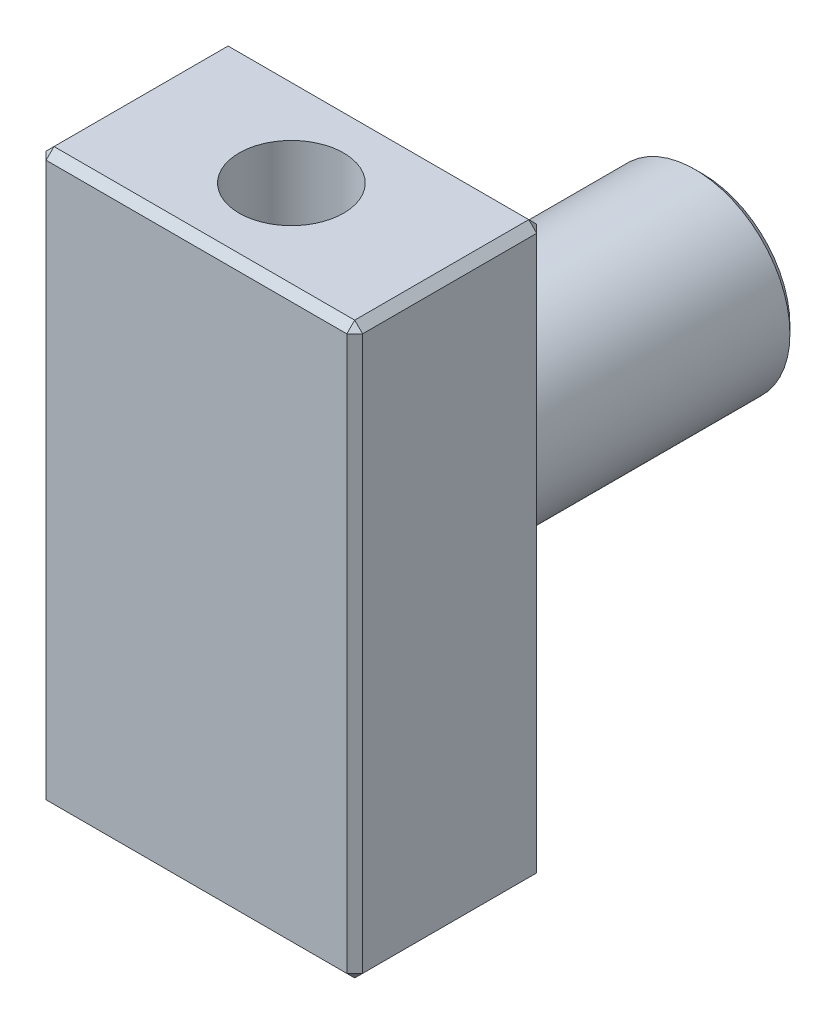
ISO-10303-21;
HEADER;
FILE_DESCRIPTION(('STEP AP214'),'2;1');
FILE_NAME('part.step','',(''),(''),'','','');
FILE_SCHEMA(('AUTOMOTIVE_DESIGN { 1 0 10303 214 1 1 1 1 }'));
ENDSEC;
DATA;
#1=APPLICATION_CONTEXT('core data for automotive mechanical design processes');
#2=APPLICATION_PROTOCOL_DEFINITION('international standard','automotive_design',2000,#1);
#3=PRODUCT_CONTEXT('',#1,'mechanical');
#4=PRODUCT('Part','Part','',(#3));
#5=PRODUCT_RELATED_PRODUCT_CATEGORY('part','',(#4));
#6=PRODUCT_DEFINITION_FORMATION('','',#4);
#7=PRODUCT_DEFINITION_CONTEXT('part definition',#1,'design');
#8=PRODUCT_DEFINITION('design','',#6,#7);
#9=PRODUCT_DEFINITION_SHAPE('','',#8);
#10=(LENGTH_UNIT() NAMED_UNIT(*) SI_UNIT(.MILLI.,.METRE.));
#11=(NAMED_UNIT(*) PLANE_ANGLE_UNIT() SI_UNIT($,.RADIAN.));
#12=(NAMED_UNIT(*) SI_UNIT($,.STERADIAN.) SOLID_ANGLE_UNIT());
#13=UNCERTAINTY_MEASURE_WITH_UNIT(LENGTH_MEASURE(1.E-05),#10,'distance_accuracy_value','');
#14=(GEOMETRIC_REPRESENTATION_CONTEXT(3) GLOBAL_UNCERTAINTY_ASSIGNED_CONTEXT((#13)) GLOBAL_UNIT_ASSIGNED_CONTEXT((#10,
#11,#12)) REPRESENTATION_CONTEXT('',''));
#15=CARTESIAN_POINT('',(0.,0.,0.));
#16=DIRECTION('',(0.,0.,1.));
#17=DIRECTION('',(1.,0.,0.));
#18=AXIS2_PLACEMENT_3D('',#15,#16,#17);
#19=CARTESIAN_POINT('',(-5.,-9.,0.));
#20=DIRECTION('',(0.,0.,1.));
#21=DIRECTION('',(1.,0.,0.));
#22=AXIS2_PLACEMENT_3D('',#19,#20,#21);
#23=PLANE('',#22);
#24=CARTESIAN_POINT('',(0.,0.,0.));
#25=DIRECTION('',(0.,0.,1.));
#26=DIRECTION('',(1.,0.,0.));
#27=AXIS2_PLACEMENT_3D('',#24,#25,#26);
#28=CIRCLE('',#27,3.25);
#29=CARTESIAN_POINT('',(3.25,0.,0.));
#30=VERTEX_POINT('',#29);
#31=EDGE_CURVE('E163',#30,#30,#28,.T.);
#32=ORIENTED_EDGE('',*,*,#31,.T.);
#33=EDGE_LOOP('',(#32));
#34=FACE_BOUND('',#33,.T.);
#35=DIRECTION('',(0.,-1.,0.));
#36=VECTOR('',#35,1.);
#37=CARTESIAN_POINT('',(4.75,-9.,0.));
#38=LINE('',#37,#36);
#39=CARTESIAN_POINT('',(4.75,8.75,0.));
#40=VERTEX_POINT('',#39);
#41=CARTESIAN_POINT('',(4.75,-8.75,0.));
#42=VERTEX_POINT('',#41);
#43=EDGE_CURVE('E158',#40,#42,#38,.T.);
#44=ORIENTED_EDGE('',*,*,#43,.T.);
#45=DIRECTION('',(-1.,0.,0.));
#46=VECTOR('',#45,1.);
#47=CARTESIAN_POINT('',(-5.,-8.75,0.));
#48=LINE('',#47,#46);
#49=CARTESIAN_POINT('',(-4.75,-8.75,0.));
#50=VERTEX_POINT('',#49);
#51=EDGE_CURVE('E160',#42,#50,#48,.T.);
#52=ORIENTED_EDGE('',*,*,#51,.T.);
#53=DIRECTION('',(0.,1.,0.));
#54=VECTOR('',#53,1.);
#55=CARTESIAN_POINT('',(-4.75,-9.,0.));
#56=LINE('',#55,#54);
#57=CARTESIAN_POINT('',(-4.75,8.75,0.));
#58=VERTEX_POINT('',#57);
#59=EDGE_CURVE('E154',#50,#58,#56,.T.);
#60=ORIENTED_EDGE('',*,*,#59,.T.);
#61=DIRECTION('',(1.,0.,0.));
#62=VECTOR('',#61,1.);
#63=CARTESIAN_POINT('',(-5.,8.75,0.));
#64=LINE('',#63,#62);
#65=EDGE_CURVE('E156',#58,#40,#64,.T.);
#66=ORIENTED_EDGE('',*,*,#65,.T.);
#67=EDGE_LOOP('',(#44,#52,#60,#66));
#68=FACE_BOUND('',#67,.T.);
#69=ADVANCED_FACE('F31',(#34,#68),#23,.F.);
#70=CARTESIAN_POINT('',(-5.,9.,6.));
#71=DIRECTION('',(1.,0.,0.));
#72=DIRECTION('',(0.,1.,0.));
#73=AXIS2_PLACEMENT_3D('',#70,#71,#72);
#74=PLANE('',#73);
#75=DIRECTION('',(0.,0.,1.));
#76=VECTOR('',#75,1.);
#77=CARTESIAN_POINT('',(-5.,-8.75,6.));
#78=LINE('',#77,#76);
#79=CARTESIAN_POINT('',(-5.,-8.75,0.250000000000004));
#80=VERTEX_POINT('',#79);
#81=CARTESIAN_POINT('',(-5.,-8.75,5.75));
#82=VERTEX_POINT('',#81);
#83=EDGE_CURVE('E168',#80,#82,#78,.T.);
#84=ORIENTED_EDGE('',*,*,#83,.T.);
#85=DIRECTION('',(0.,1.,0.));
#86=VECTOR('',#85,1.);
#87=CARTESIAN_POINT('',(-5.,9.,5.75));
#88=LINE('',#87,#86);
#89=CARTESIAN_POINT('',(-5.,8.75,5.75));
#90=VERTEX_POINT('',#89);
#91=EDGE_CURVE('E173',#82,#90,#88,.T.);
#92=ORIENTED_EDGE('',*,*,#91,.T.);
#93=DIRECTION('',(0.,0.,-1.));
#94=VECTOR('',#93,1.);
#95=CARTESIAN_POINT('',(-5.,8.75,6.));
#96=LINE('',#95,#94);
#97=CARTESIAN_POINT('',(-5.,8.75,0.250000000000004));
#98=VERTEX_POINT('',#97);
#99=EDGE_CURVE('E170',#90,#98,#96,.T.);
#100=ORIENTED_EDGE('',*,*,#99,.T.);
#101=DIRECTION('',(0.,-1.,0.));
#102=VECTOR('',#101,1.);
#103=CARTESIAN_POINT('',(-5.,9.,0.250000000000004));
#104=LINE('',#103,#102);
#105=EDGE_CURVE('E166',#98,#80,#104,.T.);
#106=ORIENTED_EDGE('',*,*,#105,.T.);
#107=EDGE_LOOP('',(#84,#92,#100,#106));
#108=FACE_BOUND('',#107,.T.);
#109=ADVANCED_FACE('F332',(#108),#74,.F.);
#110=CARTESIAN_POINT('',(-5.,-9.,6.));
#111=DIRECTION('',(0.,1.,0.));
#112=DIRECTION('',(0.,0.,1.));
#113=AXIS2_PLACEMENT_3D('',#110,#111,#112);
#114=PLANE('',#113);
#115=DIRECTION('',(-1.,0.,0.));
#116=VECTOR('',#115,1.);
#117=CARTESIAN_POINT('',(-5.,-9.,5.75));
#118=LINE('',#117,#116);
#119=CARTESIAN_POINT('',(4.75,-9.,5.75));
#120=VERTEX_POINT('',#119);
#121=CARTESIAN_POINT('',(-4.75,-9.,5.75));
#122=VERTEX_POINT('',#121);
#123=EDGE_CURVE('E188',#120,#122,#118,.T.);
#124=ORIENTED_EDGE('',*,*,#123,.T.);
#125=DIRECTION('',(0.,0.,-1.));
#126=VECTOR('',#125,1.);
#127=CARTESIAN_POINT('',(-4.75,-9.,6.));
#128=LINE('',#127,#126);
#129=CARTESIAN_POINT('',(-4.75,-9.,0.250000000000004));
#130=VERTEX_POINT('',#129);
#131=EDGE_CURVE('E190',#122,#130,#128,.T.);
#132=ORIENTED_EDGE('',*,*,#131,.T.);
#133=DIRECTION('',(1.,0.,0.));
#134=VECTOR('',#133,1.);
#135=CARTESIAN_POINT('',(-5.,-9.,0.250000000000004));
#136=LINE('',#135,#134);
#137=CARTESIAN_POINT('',(4.75,-9.,0.250000000000004));
#138=VERTEX_POINT('',#137);
#139=EDGE_CURVE('E184',#130,#138,#136,.T.);
#140=ORIENTED_EDGE('',*,*,#139,.T.);
#141=DIRECTION('',(0.,0.,1.));
#142=VECTOR('',#141,1.);
#143=CARTESIAN_POINT('',(4.75,-9.,6.));
#144=LINE('',#143,#142);
#145=EDGE_CURVE('E186',#138,#120,#144,.T.);
#146=ORIENTED_EDGE('',*,*,#145,.T.);
#147=EDGE_LOOP('',(#124,#132,#140,#146));
#148=FACE_BOUND('',#147,.T.);
#149=CARTESIAN_POINT('',(0.,-9.,3.));
#150=DIRECTION('',(0.,-1.,0.));
#151=DIRECTION('',(0.,0.,-1.));
#152=AXIS2_PLACEMENT_3D('',#149,#150,#151);
#153=CIRCLE('',#152,1.64999999999999);
#154=CARTESIAN_POINT('',(0.,-9.,1.35000000000001));
#155=VERTEX_POINT('',#154);
#156=EDGE_CURVE('E135',#155,#155,#153,.T.);
#157=ORIENTED_EDGE('',*,*,#156,.F.);
#158=EDGE_LOOP('',(#157));
#159=FACE_BOUND('',#158,.T.);
#160=ADVANCED_FACE('F310',(#148,#159),#114,.F.);
#161=CARTESIAN_POINT('',(5.,9.,6.));
#162=DIRECTION('',(-1.,0.,0.));
#163=DIRECTION('',(0.,-1.,0.));
#164=AXIS2_PLACEMENT_3D('',#161,#162,#163);
#165=PLANE('',#164);
#166=DIRECTION('',(0.,-1.,0.));
#167=VECTOR('',#166,1.);
#168=CARTESIAN_POINT('',(5.,-9.,5.75));
#169=LINE('',#168,#167);
#170=CARTESIAN_POINT('',(5.,8.75,5.75));
#171=VERTEX_POINT('',#170);
#172=CARTESIAN_POINT('',(5.,-8.75,5.75));
#173=VERTEX_POINT('',#172);
#174=EDGE_CURVE('E48',#171,#173,#169,.T.);
#175=ORIENTED_EDGE('',*,*,#174,.T.);
#176=DIRECTION('',(0.,0.,-1.));
#177=VECTOR('',#176,1.);
#178=CARTESIAN_POINT('',(5.,-8.75,6.));
#179=LINE('',#178,#177);
#180=CARTESIAN_POINT('',(5.,-8.75,0.250000000000004));
#181=VERTEX_POINT('',#180);
#182=EDGE_CURVE('E40',#173,#181,#179,.T.);
#183=ORIENTED_EDGE('',*,*,#182,.T.);
#184=DIRECTION('',(0.,1.,0.));
#185=VECTOR('',#184,1.);
#186=CARTESIAN_POINT('',(5.,9.,0.250000000000004));
#187=LINE('',#186,#185);
#188=CARTESIAN_POINT('',(5.,8.75,0.250000000000004));
#189=VERTEX_POINT('',#188);
#190=EDGE_CURVE('E202',#181,#189,#187,.T.);
#191=ORIENTED_EDGE('',*,*,#190,.T.);
#192=DIRECTION('',(0.,0.,1.));
#193=VECTOR('',#192,1.);
#194=CARTESIAN_POINT('',(5.,8.75,6.));
#195=LINE('',#194,#193);
#196=EDGE_CURVE('E53',#189,#171,#195,.T.);
#197=ORIENTED_EDGE('',*,*,#196,.T.);
#198=EDGE_LOOP('',(#175,#183,#191,#197));
#199=FACE_BOUND('',#198,.T.);
#200=ADVANCED_FACE('F287',(#199),#165,.F.);
#201=CARTESIAN_POINT('',(-5.,9.,6.));
#202=DIRECTION('',(0.,-1.,0.));
#203=DIRECTION('',(0.,0.,-1.));
#204=AXIS2_PLACEMENT_3D('',#201,#202,#203);
#205=PLANE('',#204);
#206=DIRECTION('',(-1.,0.,0.));
#207=VECTOR('',#206,1.);
#208=CARTESIAN_POINT('',(-5.,9.,0.250000000000004));
#209=LINE('',#208,#207);
#210=CARTESIAN_POINT('',(4.74999999999999,9.,0.250000000000004));
#211=VERTEX_POINT('',#210);
#212=CARTESIAN_POINT('',(-4.75,9.,0.250000000000004));
#213=VERTEX_POINT('',#212);
#214=EDGE_CURVE('E175',#211,#213,#209,.T.);
#215=ORIENTED_EDGE('',*,*,#214,.T.);
#216=DIRECTION('',(0.,0.,1.));
#217=VECTOR('',#216,1.);
#218=CARTESIAN_POINT('',(-4.75,9.,6.));
#219=LINE('',#218,#217);
#220=CARTESIAN_POINT('',(-4.75,9.,5.75));
#221=VERTEX_POINT('',#220);
#222=EDGE_CURVE('E181',#213,#221,#219,.T.);
#223=ORIENTED_EDGE('',*,*,#222,.T.);
#224=DIRECTION('',(1.,0.,0.));
#225=VECTOR('',#224,1.);
#226=CARTESIAN_POINT('',(5.,9.,5.75));
#227=LINE('',#226,#225);
#228=CARTESIAN_POINT('',(4.74999999999999,9.,5.75));
#229=VERTEX_POINT('',#228);
#230=EDGE_CURVE('E179',#221,#229,#227,.T.);
#231=ORIENTED_EDGE('',*,*,#230,.T.);
#232=DIRECTION('',(0.,0.,-1.));
#233=VECTOR('',#232,1.);
#234=CARTESIAN_POINT('',(4.74999999999999,9.,6.));
#235=LINE('',#234,#233);
#236=EDGE_CURVE('E177',#229,#211,#235,.T.);
#237=ORIENTED_EDGE('',*,*,#236,.T.);
#238=EDGE_LOOP('',(#215,#223,#231,#237));
#239=FACE_BOUND('',#238,.T.);
#240=CARTESIAN_POINT('',(0.,9.,3.));
#241=DIRECTION('',(0.,1.,0.));
#242=DIRECTION('',(0.,0.,1.));
#243=AXIS2_PLACEMENT_3D('',#240,#241,#242);
#244=CIRCLE('',#243,1.64999999999999);
#245=CARTESIAN_POINT('',(0.,9.,4.64999999999999));
#246=VERTEX_POINT('',#245);
#247=EDGE_CURVE('E145',#246,#246,#244,.T.);
#248=ORIENTED_EDGE('',*,*,#247,.F.);
#249=EDGE_LOOP('',(#248));
#250=FACE_BOUND('',#249,.T.);
#251=ADVANCED_FACE('F352',(#239,#250),#205,.F.);
#252=CARTESIAN_POINT('',(-5.,-9.,6.));
#253=DIRECTION('',(0.,0.,1.));
#254=DIRECTION('',(1.,0.,0.));
#255=AXIS2_PLACEMENT_3D('',#252,#253,#254);
#256=PLANE('',#255);
#257=DIRECTION('',(0.,1.,0.));
#258=VECTOR('',#257,1.);
#259=CARTESIAN_POINT('',(4.74999999999999,9.,6.));
#260=LINE('',#259,#258);
#261=CARTESIAN_POINT('',(4.75,-8.75,6.));
#262=VERTEX_POINT('',#261);
#263=CARTESIAN_POINT('',(4.74999999999999,8.75,6.));
#264=VERTEX_POINT('',#263);
#265=EDGE_CURVE('E193',#262,#264,#260,.T.);
#266=ORIENTED_EDGE('',*,*,#265,.T.);
#267=DIRECTION('',(-1.,0.,0.));
#268=VECTOR('',#267,1.);
#269=CARTESIAN_POINT('',(-5.,8.75,6.));
#270=LINE('',#269,#268);
#271=CARTESIAN_POINT('',(-4.75,8.75,6.));
#272=VERTEX_POINT('',#271);
#273=EDGE_CURVE('E199',#264,#272,#270,.T.);
#274=ORIENTED_EDGE('',*,*,#273,.T.);
#275=DIRECTION('',(0.,-1.,0.));
#276=VECTOR('',#275,1.);
#277=CARTESIAN_POINT('',(-4.75,-9.,6.));
#278=LINE('',#277,#276);
#279=CARTESIAN_POINT('',(-4.75,-8.75,6.));
#280=VERTEX_POINT('',#279);
#281=EDGE_CURVE('E197',#272,#280,#278,.T.);
#282=ORIENTED_EDGE('',*,*,#281,.T.);
#283=DIRECTION('',(1.,0.,0.));
#284=VECTOR('',#283,1.);
#285=CARTESIAN_POINT('',(5.,-8.75,6.));
#286=LINE('',#285,#284);
#287=EDGE_CURVE('E195',#280,#262,#286,.T.);
#288=ORIENTED_EDGE('',*,*,#287,.T.);
#289=EDGE_LOOP('',(#266,#274,#282,#288));
#290=FACE_BOUND('',#289,.T.);
#291=ADVANCED_FACE('F359',(#290),#256,.T.);
#292=CARTESIAN_POINT('',(0.,0.,-10.));
#293=DIRECTION('',(0.,0.,1.));
#294=DIRECTION('',(1.,0.,0.));
#295=AXIS2_PLACEMENT_3D('',#292,#293,#294);
#296=CYLINDRICAL_SURFACE('',#295,3.);
#297=CARTESIAN_POINT('',(0.,0.,-0.250000000000005));
#298=DIRECTION('',(0.,0.,1.));
#299=DIRECTION('',(1.,0.,0.));
#300=AXIS2_PLACEMENT_3D('',#297,#298,#299);
#301=CIRCLE('',#300,3.);
#302=CARTESIAN_POINT('',(3.,0.,-0.250000000000005));
#303=VERTEX_POINT('',#302);
#304=EDGE_CURVE('E151',#303,#303,#301,.F.);
#305=ORIENTED_EDGE('',*,*,#304,.T.);
#306=EDGE_LOOP('',(#305));
#307=FACE_BOUND('',#306,.T.);
#308=CARTESIAN_POINT('',(0.,0.,-9.75));
#309=DIRECTION('',(0.,0.,-1.));
#310=DIRECTION('',(-1.,0.,0.));
#311=AXIS2_PLACEMENT_3D('',#308,#309,#310);
#312=CIRCLE('',#311,3.);
#313=CARTESIAN_POINT('',(-3.,0.,-9.75));
#314=VERTEX_POINT('',#313);
#315=EDGE_CURVE('E148',#314,#314,#312,.F.);
#316=ORIENTED_EDGE('',*,*,#315,.T.);
#317=EDGE_LOOP('',(#316));
#318=FACE_BOUND('',#317,.T.);
#319=ADVANCED_FACE('F361',(#307,#318),#296,.T.);
#320=CARTESIAN_POINT('',(0.,0.,-10.));
#321=DIRECTION('',(0.,0.,-1.));
#322=DIRECTION('',(-1.,0.,0.));
#323=AXIS2_PLACEMENT_3D('',#320,#321,#322);
#324=PLANE('',#323);
#325=CARTESIAN_POINT('',(0.,0.,-10.));
#326=DIRECTION('',(0.,0.,-1.));
#327=DIRECTION('',(-1.,0.,0.));
#328=AXIS2_PLACEMENT_3D('',#325,#326,#327);
#329=CIRCLE('',#328,2.75);
#330=CARTESIAN_POINT('',(-2.75,0.,-10.));
#331=VERTEX_POINT('',#330);
#332=EDGE_CURVE('E11',#331,#331,#329,.T.);
#333=ORIENTED_EDGE('',*,*,#332,.T.);
#334=EDGE_LOOP('',(#333));
#335=FACE_BOUND('',#334,.T.);
#336=ADVANCED_FACE('F367',(#335),#324,.T.);
#337=CARTESIAN_POINT('',(0.,9.,3.));
#338=DIRECTION('',(0.,1.,0.));
#339=DIRECTION('',(0.,0.,1.));
#340=AXIS2_PLACEMENT_3D('',#337,#338,#339);
#341=CYLINDRICAL_SURFACE('',#340,1.64999999999999);
#342=CARTESIAN_POINT('',(0.,0.999999999999999,3.));
#343=DIRECTION('',(0.,1.,0.));
#344=DIRECTION('',(0.,0.,1.));
#345=AXIS2_PLACEMENT_3D('',#342,#343,#344);
#346=CIRCLE('',#345,1.65);
#347=CARTESIAN_POINT('',(0.,0.999999999999999,4.65));
#348=VERTEX_POINT('',#347);
#349=EDGE_CURVE('E138',#348,#348,#346,.T.);
#350=ORIENTED_EDGE('',*,*,#349,.F.);
#351=EDGE_LOOP('',(#350));
#352=FACE_BOUND('',#351,.T.);
#353=ORIENTED_EDGE('',*,*,#247,.T.);
#354=EDGE_LOOP('',(#353));
#355=FACE_BOUND('',#354,.T.);
#356=ADVANCED_FACE('F582',(#352,#355),#341,.F.);
#357=CARTESIAN_POINT('',(0.,0.999999999999999,3.));
#358=DIRECTION('',(0.,1.,0.));
#359=DIRECTION('',(0.,0.,1.));
#360=AXIS2_PLACEMENT_3D('',#357,#358,#359);
#361=CONICAL_SURFACE('',#360,1.65,1.02974425867665);
#362=CARTESIAN_POINT('',(0.,0.00857997860452368,3.));
#363=VERTEX_POINT('',#362);
#364=VERTEX_LOOP('',#363);
#365=FACE_BOUND('',#364,.T.);
#366=ORIENTED_EDGE('',*,*,#349,.T.);
#367=EDGE_LOOP('',(#366));
#368=FACE_BOUND('',#367,.T.);
#369=ADVANCED_FACE('F574',(#365,#368),#361,.F.);
#370=CARTESIAN_POINT('',(0.,-9.,3.));
#371=DIRECTION('',(0.,-1.,0.));
#372=DIRECTION('',(0.,0.,-1.));
#373=AXIS2_PLACEMENT_3D('',#370,#371,#372);
#374=CYLINDRICAL_SURFACE('',#373,1.64999999999999);
#375=CARTESIAN_POINT('',(0.,-0.999999999999999,3.));
#376=DIRECTION('',(0.,-1.,0.));
#377=DIRECTION('',(0.,0.,-1.));
#378=AXIS2_PLACEMENT_3D('',#375,#376,#377);
#379=CIRCLE('',#378,1.65);
#380=CARTESIAN_POINT('',(0.,-0.999999999999999,1.35));
#381=VERTEX_POINT('',#380);
#382=EDGE_CURVE('E133',#381,#381,#379,.T.);
#383=ORIENTED_EDGE('',*,*,#382,.F.);
#384=EDGE_LOOP('',(#383));
#385=FACE_BOUND('',#384,.T.);
#386=ORIENTED_EDGE('',*,*,#156,.T.);
#387=EDGE_LOOP('',(#386));
#388=FACE_BOUND('',#387,.T.);
#389=ADVANCED_FACE('F129',(#385,#388),#374,.F.);
#390=CARTESIAN_POINT('',(0.,-0.999999999999999,3.));
#391=DIRECTION('',(0.,-1.,0.));
#392=DIRECTION('',(0.,0.,-1.));
#393=AXIS2_PLACEMENT_3D('',#390,#391,#392);
#394=CONICAL_SURFACE('',#393,1.65,1.02974425867665);
#395=CARTESIAN_POINT('',(0.,-0.00857997860452368,3.));
#396=VERTEX_POINT('',#395);
#397=VERTEX_LOOP('',#396);
#398=FACE_BOUND('',#397,.T.);
#399=ORIENTED_EDGE('',*,*,#382,.T.);
#400=EDGE_LOOP('',(#399));
#401=FACE_BOUND('',#400,.T.);
#402=ADVANCED_FACE('F125',(#398,#401),#394,.F.);
#403=CARTESIAN_POINT('',(0.,0.,-0.250000000000005));
#404=DIRECTION('',(0.,0.,1.));
#405=DIRECTION('',(1.,0.,0.));
#406=AXIS2_PLACEMENT_3D('',#403,#404,#405);
#407=CONICAL_SURFACE('',#406,3.,0.785398163397442);
#408=ORIENTED_EDGE('',*,*,#31,.F.);
#409=EDGE_LOOP('',(#408));
#410=FACE_BOUND('',#409,.T.);
#411=ORIENTED_EDGE('',*,*,#304,.F.);
#412=EDGE_LOOP('',(#411));
#413=FACE_BOUND('',#412,.T.);
#414=ADVANCED_FACE('F128',(#410,#413),#407,.T.);
#415=CARTESIAN_POINT('',(5.,-8.75,6.));
#416=DIRECTION('',(-0.707106781186552,0.707106781186542,0.));
#417=DIRECTION('',(-0.707106781186543,-0.707106781186552,0.));
#418=AXIS2_PLACEMENT_3D('',#415,#416,#417);
#419=PLANE('',#418);
#420=DIRECTION('',(-0.707106781186543,-0.707106781186552,0.));
#421=VECTOR('',#420,1.);
#422=CARTESIAN_POINT('',(4.875,-8.875,5.75));
#423=LINE('',#422,#421);
#424=EDGE_CURVE('E35',#120,#173,#423,.F.);
#425=ORIENTED_EDGE('',*,*,#424,.F.);
#426=ORIENTED_EDGE('',*,*,#145,.F.);
#427=DIRECTION('',(0.707106781186543,0.707106781186552,0.));
#428=VECTOR('',#427,1.);
#429=CARTESIAN_POINT('',(5.,-8.75,0.250000000000004));
#430=LINE('',#429,#428);
#431=EDGE_CURVE('E141',#181,#138,#430,.F.);
#432=ORIENTED_EDGE('',*,*,#431,.F.);
#433=ORIENTED_EDGE('',*,*,#182,.F.);
#434=EDGE_LOOP('',(#425,#426,#432,#433));
#435=FACE_BOUND('',#434,.T.);
#436=ADVANCED_FACE('F308',(#435),#419,.F.);
#437=CARTESIAN_POINT('',(4.75,-8.75,6.));
#438=DIRECTION('',(0.577350269189626,-0.577350269189618,0.577350269189634));
#439=DIRECTION('',(0.707106781186552,0.,-0.707106781186543));
#440=AXIS2_PLACEMENT_3D('',#437,#438,#439);
#441=PLANE('',#440);
#442=DIRECTION('',(0.,-0.707106781186552,-0.707106781186543));
#443=VECTOR('',#442,1.);
#444=CARTESIAN_POINT('',(4.75,-8.75,6.));
#445=LINE('',#444,#443);
#446=EDGE_CURVE('E263',#120,#262,#445,.F.);
#447=ORIENTED_EDGE('',*,*,#446,.F.);
#448=ORIENTED_EDGE('',*,*,#424,.T.);
#449=DIRECTION('',(-0.707106781186553,0.,0.707106781186543));
#450=VECTOR('',#449,1.);
#451=CARTESIAN_POINT('',(4.75,-8.75,6.));
#452=LINE('',#451,#450);
#453=EDGE_CURVE('E266',#262,#173,#452,.F.);
#454=ORIENTED_EDGE('',*,*,#453,.F.);
#455=EDGE_LOOP('',(#447,#448,#454));
#456=FACE_BOUND('',#455,.T.);
#457=ADVANCED_FACE('F305',(#456),#441,.T.);
#458=CARTESIAN_POINT('',(5.,-8.75,0.250000000000004));
#459=DIRECTION('',(0.577350269189634,-0.577350269189626,-0.577350269189618));
#460=DIRECTION('',(0.707106781186543,0.707106781186552,0.));
#461=AXIS2_PLACEMENT_3D('',#458,#459,#460);
#462=PLANE('',#461);
#463=DIRECTION('',(-0.707106781186543,0.,-0.707106781186552));
#464=VECTOR('',#463,1.);
#465=CARTESIAN_POINT('',(5.,-8.75,0.250000000000004));
#466=LINE('',#465,#464);
#467=EDGE_CURVE('E257',#181,#42,#466,.T.);
#468=ORIENTED_EDGE('',*,*,#467,.F.);
#469=ORIENTED_EDGE('',*,*,#431,.T.);
#470=DIRECTION('',(0.,-0.707106781186543,0.707106781186552));
#471=VECTOR('',#470,1.);
#472=CARTESIAN_POINT('',(4.75,-8.875,0.125000000000002));
#473=LINE('',#472,#471);
#474=EDGE_CURVE('E260',#42,#138,#473,.T.);
#475=ORIENTED_EDGE('',*,*,#474,.F.);
#476=EDGE_LOOP('',(#468,#469,#475));
#477=FACE_BOUND('',#476,.T.);
#478=ADVANCED_FACE('F273',(#477),#462,.T.);
#479=CARTESIAN_POINT('',(4.75,-9.,6.));
#480=DIRECTION('',(0.707106781186542,0.,0.707106781186552));
#481=DIRECTION('',(0.707106781186552,0.,-0.707106781186543));
#482=AXIS2_PLACEMENT_3D('',#479,#480,#481);
#483=PLANE('',#482);
#484=ORIENTED_EDGE('',*,*,#453,.T.);
#485=ORIENTED_EDGE('',*,*,#174,.F.);
#486=DIRECTION('',(0.707106781186552,0.,-0.707106781186543));
#487=VECTOR('',#486,1.);
#488=CARTESIAN_POINT('',(4.875,8.75,5.875));
#489=LINE('',#488,#487);
#490=EDGE_CURVE('E251',#264,#171,#489,.T.);
#491=ORIENTED_EDGE('',*,*,#490,.F.);
#492=ORIENTED_EDGE('',*,*,#265,.F.);
#493=EDGE_LOOP('',(#484,#485,#491,#492));
#494=FACE_BOUND('',#493,.T.);
#495=ADVANCED_FACE('F301',(#494),#483,.T.);
#496=CARTESIAN_POINT('',(-5.,-8.75,6.));
#497=DIRECTION('',(0.,-0.707106781186542,0.707106781186552));
#498=DIRECTION('',(0.,-0.707106781186552,-0.707106781186543));
#499=AXIS2_PLACEMENT_3D('',#496,#497,#498);
#500=PLANE('',#499);
#501=ORIENTED_EDGE('',*,*,#446,.T.);
#502=ORIENTED_EDGE('',*,*,#287,.F.);
#503=DIRECTION('',(0.,0.707106781186552,0.707106781186543));
#504=VECTOR('',#503,1.);
#505=CARTESIAN_POINT('',(-4.75,-8.875,5.875));
#506=LINE('',#505,#504);
#507=EDGE_CURVE('E248',#122,#280,#506,.T.);
#508=ORIENTED_EDGE('',*,*,#507,.F.);
#509=ORIENTED_EDGE('',*,*,#123,.F.);
#510=EDGE_LOOP('',(#501,#502,#508,#509));
#511=FACE_BOUND('',#510,.T.);
#512=ADVANCED_FACE('F322',(#511),#500,.T.);
#513=CARTESIAN_POINT('',(-4.75,-9.,6.));
#514=DIRECTION('',(0.707106781186552,0.707106781186542,0.));
#515=DIRECTION('',(-0.707106781186543,0.707106781186552,0.));
#516=AXIS2_PLACEMENT_3D('',#513,#514,#515);
#517=PLANE('',#516);
#518=DIRECTION('',(0.707106781186543,-0.707106781186552,0.));
#519=VECTOR('',#518,1.);
#520=CARTESIAN_POINT('',(-4.75,-9.,0.250000000000004));
#521=LINE('',#520,#519);
#522=EDGE_CURVE('E242',#130,#80,#521,.F.);
#523=ORIENTED_EDGE('',*,*,#522,.F.);
#524=ORIENTED_EDGE('',*,*,#131,.F.);
#525=DIRECTION('',(-0.707106781186543,0.707106781186552,0.));
#526=VECTOR('',#525,1.);
#527=CARTESIAN_POINT('',(-5.,-8.75,5.75));
#528=LINE('',#527,#526);
#529=EDGE_CURVE('E245',#82,#122,#528,.F.);
#530=ORIENTED_EDGE('',*,*,#529,.F.);
#531=ORIENTED_EDGE('',*,*,#83,.F.);
#532=EDGE_LOOP('',(#523,#524,#530,#531));
#533=FACE_BOUND('',#532,.T.);
#534=ADVANCED_FACE('F317',(#533),#517,.F.);
#535=CARTESIAN_POINT('',(-5.,-9.,0.250000000000004));
#536=DIRECTION('',(0.,0.707106781186552,0.707106781186542));
#537=DIRECTION('',(0.,-0.707106781186543,0.707106781186552));
#538=AXIS2_PLACEMENT_3D('',#535,#536,#537);
#539=PLANE('',#538);
#540=ORIENTED_EDGE('',*,*,#474,.T.);
#541=ORIENTED_EDGE('',*,*,#139,.F.);
#542=DIRECTION('',(0.,0.707106781186543,-0.707106781186552));
#543=VECTOR('',#542,1.);
#544=CARTESIAN_POINT('',(-4.75,-9.,0.250000000000004));
#545=LINE('',#544,#543);
#546=EDGE_CURVE('E240',#50,#130,#545,.F.);
#547=ORIENTED_EDGE('',*,*,#546,.F.);
#548=ORIENTED_EDGE('',*,*,#51,.F.);
#549=EDGE_LOOP('',(#540,#541,#547,#548));
#550=FACE_BOUND('',#549,.T.);
#551=ADVANCED_FACE('F279',(#550),#539,.F.);
#552=CARTESIAN_POINT('',(5.,9.,0.250000000000004));
#553=DIRECTION('',(-0.707106781186552,0.,0.707106781186542));
#554=DIRECTION('',(0.707106781186543,0.,0.707106781186552));
#555=AXIS2_PLACEMENT_3D('',#552,#553,#554);
#556=PLANE('',#555);
#557=ORIENTED_EDGE('',*,*,#467,.T.);
#558=ORIENTED_EDGE('',*,*,#43,.F.);
#559=DIRECTION('',(0.707106781186543,0.,0.707106781186552));
#560=VECTOR('',#559,1.);
#561=CARTESIAN_POINT('',(4.875,8.75,0.125000000000002));
#562=LINE('',#561,#560);
#563=EDGE_CURVE('E237',#189,#40,#562,.F.);
#564=ORIENTED_EDGE('',*,*,#563,.F.);
#565=ORIENTED_EDGE('',*,*,#190,.F.);
#566=EDGE_LOOP('',(#557,#558,#564,#565));
#567=FACE_BOUND('',#566,.T.);
#568=ADVANCED_FACE('F286',(#567),#556,.F.);
#569=CARTESIAN_POINT('',(4.74999999999999,9.,6.));
#570=DIRECTION('',(-0.707106781186542,-0.707106781186552,0.));
#571=DIRECTION('',(0.707106781186552,-0.707106781186543,0.));
#572=AXIS2_PLACEMENT_3D('',#569,#570,#571);
#573=PLANE('',#572);
#574=DIRECTION('',(0.707106781186552,-0.707106781186543,0.));
#575=VECTOR('',#574,1.);
#576=CARTESIAN_POINT('',(4.74999999999999,9.,5.75));
#577=LINE('',#576,#575);
#578=EDGE_CURVE('E254',#171,#229,#577,.F.);
#579=ORIENTED_EDGE('',*,*,#578,.F.);
#580=ORIENTED_EDGE('',*,*,#196,.F.);
#581=DIRECTION('',(-0.707106781186552,0.707106781186543,0.));
#582=VECTOR('',#581,1.);
#583=CARTESIAN_POINT('',(4.74999999999999,9.,0.250000000000004));
#584=LINE('',#583,#582);
#585=EDGE_CURVE('E234',#211,#189,#584,.F.);
#586=ORIENTED_EDGE('',*,*,#585,.F.);
#587=ORIENTED_EDGE('',*,*,#236,.F.);
#588=EDGE_LOOP('',(#579,#580,#586,#587));
#589=FACE_BOUND('',#588,.T.);
#590=ADVANCED_FACE('F291',(#589),#573,.F.);
#591=CARTESIAN_POINT('',(4.74999999999999,9.,5.75));
#592=DIRECTION('',(0.577350269189618,0.577350269189626,0.577350269189634));
#593=DIRECTION('',(0.,-0.707106781186552,0.707106781186543));
#594=AXIS2_PLACEMENT_3D('',#591,#592,#593);
#595=PLANE('',#594);
#596=ORIENTED_EDGE('',*,*,#490,.T.);
#597=ORIENTED_EDGE('',*,*,#578,.T.);
#598=DIRECTION('',(0.,-0.707106781186552,0.707106781186543));
#599=VECTOR('',#598,1.);
#600=CARTESIAN_POINT('',(4.74999999999999,9.,5.75));
#601=LINE('',#600,#599);
#602=EDGE_CURVE('E231',#264,#229,#601,.F.);
#603=ORIENTED_EDGE('',*,*,#602,.F.);
#604=EDGE_LOOP('',(#596,#597,#603));
#605=FACE_BOUND('',#604,.T.);
#606=ADVANCED_FACE('F297',(#605),#595,.T.);
#607=CARTESIAN_POINT('',(-5.,-8.75,5.75));
#608=DIRECTION('',(-0.577350269189634,-0.577350269189618,0.577350269189626));
#609=DIRECTION('',(0.707106781186543,0.,0.707106781186552));
#610=AXIS2_PLACEMENT_3D('',#607,#608,#609);
#611=PLANE('',#610);
#612=ORIENTED_EDGE('',*,*,#529,.T.);
#613=ORIENTED_EDGE('',*,*,#507,.T.);
#614=DIRECTION('',(-0.707106781186543,0.,-0.707106781186552));
#615=VECTOR('',#614,1.);
#616=CARTESIAN_POINT('',(-5.,-8.75,5.75));
#617=LINE('',#616,#615);
#618=EDGE_CURVE('E228',#82,#280,#617,.F.);
#619=ORIENTED_EDGE('',*,*,#618,.F.);
#620=EDGE_LOOP('',(#612,#613,#619));
#621=FACE_BOUND('',#620,.T.);
#622=ADVANCED_FACE('F324',(#621),#611,.T.);
#623=CARTESIAN_POINT('',(-4.75,-9.,0.250000000000004));
#624=DIRECTION('',(-0.577350269189634,-0.577350269189626,-0.577350269189618));
#625=DIRECTION('',(0.707106781186543,-0.707106781186552,0.));
#626=AXIS2_PLACEMENT_3D('',#623,#624,#625);
#627=PLANE('',#626);
#628=ORIENTED_EDGE('',*,*,#546,.T.);
#629=ORIENTED_EDGE('',*,*,#522,.T.);
#630=DIRECTION('',(-0.707106781186543,0.,0.707106781186553));
#631=VECTOR('',#630,1.);
#632=CARTESIAN_POINT('',(-4.875,-8.75,0.125000000000002));
#633=LINE('',#632,#631);
#634=EDGE_CURVE('E225',#50,#80,#633,.T.);
#635=ORIENTED_EDGE('',*,*,#634,.F.);
#636=EDGE_LOOP('',(#628,#629,#635));
#637=FACE_BOUND('',#636,.T.);
#638=ADVANCED_FACE('F337',(#637),#627,.T.);
#639=CARTESIAN_POINT('',(4.74999999999999,9.,0.250000000000004));
#640=DIRECTION('',(0.577350269189626,0.577350269189634,-0.577350269189618));
#641=DIRECTION('',(-0.707106781186552,0.707106781186543,0.));
#642=AXIS2_PLACEMENT_3D('',#639,#640,#641);
#643=PLANE('',#642);
#644=ORIENTED_EDGE('',*,*,#585,.T.);
#645=ORIENTED_EDGE('',*,*,#563,.T.);
#646=DIRECTION('',(0.,-0.707106781186543,-0.707106781186552));
#647=VECTOR('',#646,1.);
#648=CARTESIAN_POINT('',(4.74999999999999,9.,0.250000000000004));
#649=LINE('',#648,#647);
#650=EDGE_CURVE('E222',#211,#40,#649,.T.);
#651=ORIENTED_EDGE('',*,*,#650,.F.);
#652=EDGE_LOOP('',(#644,#645,#651));
#653=FACE_BOUND('',#652,.T.);
#654=ADVANCED_FACE('F402',(#653),#643,.T.);
#655=CARTESIAN_POINT('',(-5.,8.75,6.));
#656=DIRECTION('',(0.,0.707106781186542,0.707106781186552));
#657=DIRECTION('',(0.,-0.707106781186552,0.707106781186543));
#658=AXIS2_PLACEMENT_3D('',#655,#656,#657);
#659=PLANE('',#658);
#660=ORIENTED_EDGE('',*,*,#602,.T.);
#661=ORIENTED_EDGE('',*,*,#230,.F.);
#662=DIRECTION('',(0.,0.707106781186552,-0.707106781186543));
#663=VECTOR('',#662,1.);
#664=CARTESIAN_POINT('',(-4.75,9.,5.75));
#665=LINE('',#664,#663);
#666=EDGE_CURVE('E219',#272,#221,#665,.T.);
#667=ORIENTED_EDGE('',*,*,#666,.F.);
#668=ORIENTED_EDGE('',*,*,#273,.F.);
#669=EDGE_LOOP('',(#660,#661,#667,#668));
#670=FACE_BOUND('',#669,.T.);
#671=ADVANCED_FACE('F357',(#670),#659,.T.);
#672=CARTESIAN_POINT('',(-4.75,-9.,6.));
#673=DIRECTION('',(-0.707106781186552,0.,0.707106781186542));
#674=DIRECTION('',(0.707106781186543,0.,0.707106781186552));
#675=AXIS2_PLACEMENT_3D('',#672,#673,#674);
#676=PLANE('',#675);
#677=ORIENTED_EDGE('',*,*,#618,.T.);
#678=ORIENTED_EDGE('',*,*,#281,.F.);
#679=DIRECTION('',(0.707106781186543,0.,0.707106781186552));
#680=VECTOR('',#679,1.);
#681=CARTESIAN_POINT('',(-4.875,8.75,5.875));
#682=LINE('',#681,#680);
#683=EDGE_CURVE('E217',#90,#272,#682,.T.);
#684=ORIENTED_EDGE('',*,*,#683,.F.);
#685=ORIENTED_EDGE('',*,*,#91,.F.);
#686=EDGE_LOOP('',(#677,#678,#684,#685));
#687=FACE_BOUND('',#686,.T.);
#688=ADVANCED_FACE('F329',(#687),#676,.T.);
#689=CARTESIAN_POINT('',(-5.,9.,0.250000000000004));
#690=DIRECTION('',(0.707106781186552,0.,0.707106781186542));
#691=DIRECTION('',(0.707106781186543,0.,-0.707106781186552));
#692=AXIS2_PLACEMENT_3D('',#689,#690,#691);
#693=PLANE('',#692);
#694=ORIENTED_EDGE('',*,*,#634,.T.);
#695=ORIENTED_EDGE('',*,*,#105,.F.);
#696=DIRECTION('',(0.707106781186542,0.,-0.707106781186552));
#697=VECTOR('',#696,1.);
#698=CARTESIAN_POINT('',(-5.,8.75,0.250000000000004));
#699=LINE('',#698,#697);
#700=EDGE_CURVE('E214',#58,#98,#699,.F.);
#701=ORIENTED_EDGE('',*,*,#700,.F.);
#702=ORIENTED_EDGE('',*,*,#59,.F.);
#703=EDGE_LOOP('',(#694,#695,#701,#702));
#704=FACE_BOUND('',#703,.T.);
#705=ADVANCED_FACE('F339',(#704),#693,.F.);
#706=CARTESIAN_POINT('',(-5.,9.,0.250000000000004));
#707=DIRECTION('',(0.,-0.707106781186552,0.707106781186542));
#708=DIRECTION('',(0.,-0.707106781186543,-0.707106781186552));
#709=AXIS2_PLACEMENT_3D('',#706,#707,#708);
#710=PLANE('',#709);
#711=ORIENTED_EDGE('',*,*,#650,.T.);
#712=ORIENTED_EDGE('',*,*,#65,.F.);
#713=DIRECTION('',(0.,0.707106781186543,0.707106781186552));
#714=VECTOR('',#713,1.);
#715=CARTESIAN_POINT('',(-4.75,8.875,0.125000000000002));
#716=LINE('',#715,#714);
#717=EDGE_CURVE('E211',#213,#58,#716,.F.);
#718=ORIENTED_EDGE('',*,*,#717,.F.);
#719=ORIENTED_EDGE('',*,*,#214,.F.);
#720=EDGE_LOOP('',(#711,#712,#718,#719));
#721=FACE_BOUND('',#720,.T.);
#722=ADVANCED_FACE('F348',(#721),#710,.F.);
#723=CARTESIAN_POINT('',(-4.75,9.,5.75));
#724=DIRECTION('',(-0.577350269189634,0.577350269189618,0.577350269189626));
#725=DIRECTION('',(0.707106781186543,0.,0.707106781186552));
#726=AXIS2_PLACEMENT_3D('',#723,#724,#725);
#727=PLANE('',#726);
#728=ORIENTED_EDGE('',*,*,#683,.T.);
#729=ORIENTED_EDGE('',*,*,#666,.T.);
#730=DIRECTION('',(0.707106781186543,0.707106781186552,0.));
#731=VECTOR('',#730,1.);
#732=CARTESIAN_POINT('',(-4.75,9.,5.75));
#733=LINE('',#732,#731);
#734=EDGE_CURVE('E209',#90,#221,#733,.T.);
#735=ORIENTED_EDGE('',*,*,#734,.F.);
#736=EDGE_LOOP('',(#728,#729,#735));
#737=FACE_BOUND('',#736,.T.);
#738=ADVANCED_FACE('F390',(#737),#727,.T.);
#739=CARTESIAN_POINT('',(-5.,8.75,0.250000000000004));
#740=DIRECTION('',(-0.577350269189634,0.577350269189626,-0.577350269189618));
#741=DIRECTION('',(-0.707106781186543,-0.707106781186552,0.));
#742=AXIS2_PLACEMENT_3D('',#739,#740,#741);
#743=PLANE('',#742);
#744=ORIENTED_EDGE('',*,*,#717,.T.);
#745=ORIENTED_EDGE('',*,*,#700,.T.);
#746=DIRECTION('',(-0.707106781186543,-0.707106781186552,0.));
#747=VECTOR('',#746,1.);
#748=CARTESIAN_POINT('',(-5.,8.75,0.250000000000004));
#749=LINE('',#748,#747);
#750=EDGE_CURVE('E207',#213,#98,#749,.T.);
#751=ORIENTED_EDGE('',*,*,#750,.F.);
#752=EDGE_LOOP('',(#744,#745,#751));
#753=FACE_BOUND('',#752,.T.);
#754=ADVANCED_FACE('F344',(#753),#743,.T.);
#755=CARTESIAN_POINT('',(-5.,8.75,6.));
#756=DIRECTION('',(0.707106781186552,-0.707106781186542,0.));
#757=DIRECTION('',(0.707106781186543,0.707106781186552,0.));
#758=AXIS2_PLACEMENT_3D('',#755,#756,#757);
#759=PLANE('',#758);
#760=ORIENTED_EDGE('',*,*,#734,.T.);
#761=ORIENTED_EDGE('',*,*,#222,.F.);
#762=ORIENTED_EDGE('',*,*,#750,.T.);
#763=ORIENTED_EDGE('',*,*,#99,.F.);
#764=EDGE_LOOP('',(#760,#761,#762,#763));
#765=FACE_BOUND('',#764,.T.);
#766=ADVANCED_FACE('F350',(#765),#759,.F.);
#767=CARTESIAN_POINT('',(0.,0.,-10.));
#768=DIRECTION('',(0.,0.,1.));
#769=DIRECTION('',(1.,0.,0.));
#770=AXIS2_PLACEMENT_3D('',#767,#768,#769);
#771=CONICAL_SURFACE('',#770,2.75,0.785398163397447);
#772=ORIENTED_EDGE('',*,*,#315,.F.);
#773=EDGE_LOOP('',(#772));
#774=FACE_BOUND('',#773,.T.);
#775=ORIENTED_EDGE('',*,*,#332,.F.);
#776=EDGE_LOOP('',(#775));
#777=FACE_BOUND('',#776,.T.);
#778=ADVANCED_FACE('F33',(#774,#777),#771,.T.);
#779=CLOSED_SHELL('',(#69,#109,#160,#200,#251,#291,#319,#336,#356,#369,#389,#402,#414,#436,#457,
#478,#495,#512,#534,#551,#568,#590,#606,#622,#638,#654,#671,#688,#705,#722,#738,#754,#766,#778));
#780=MANIFOLD_SOLID_BREP('B2',#779);
#781=ADVANCED_BREP_SHAPE_REPRESENTATION('',(#18,#780),#14);
#782=SHAPE_DEFINITION_REPRESENTATION(#9,#781);
ENDSEC;
END-ISO-10303-21;
